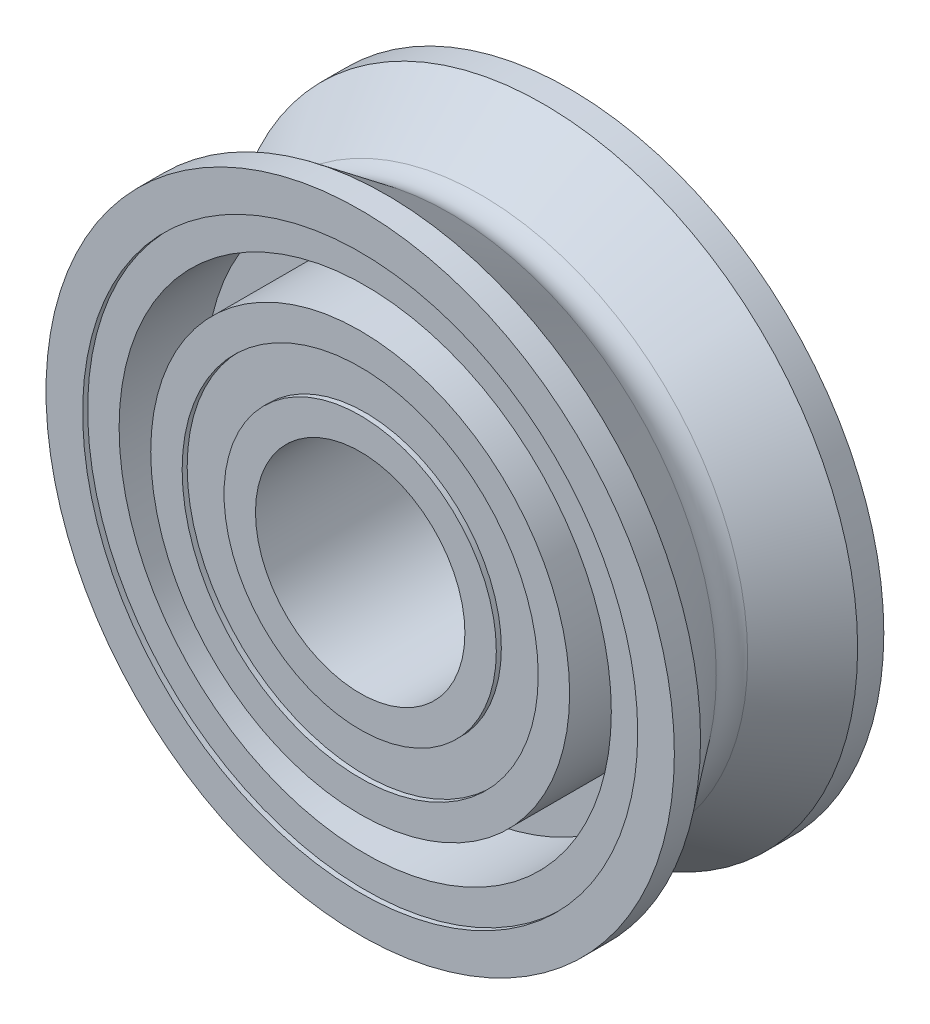
ISO-10303-21;
HEADER;
FILE_DESCRIPTION(('STEP AP214'),'2;1');
FILE_NAME('part.step','',(''),(''),'','','');
FILE_SCHEMA(('AUTOMOTIVE_DESIGN { 1 0 10303 214 1 1 1 1 }'));
ENDSEC;
DATA;
#1=APPLICATION_CONTEXT('core data for automotive mechanical design processes');
#2=APPLICATION_PROTOCOL_DEFINITION('international standard','automotive_design',2000,#1);
#3=PRODUCT_CONTEXT('',#1,'mechanical');
#4=PRODUCT('Part','Part','',(#3));
#5=PRODUCT_RELATED_PRODUCT_CATEGORY('part','',(#4));
#6=PRODUCT_DEFINITION_FORMATION('','',#4);
#7=PRODUCT_DEFINITION_CONTEXT('part definition',#1,'design');
#8=PRODUCT_DEFINITION('design','',#6,#7);
#9=PRODUCT_DEFINITION_SHAPE('','',#8);
#10=(LENGTH_UNIT() NAMED_UNIT(*) SI_UNIT(.MILLI.,.METRE.));
#11=(NAMED_UNIT(*) PLANE_ANGLE_UNIT() SI_UNIT($,.RADIAN.));
#12=(NAMED_UNIT(*) SI_UNIT($,.STERADIAN.) SOLID_ANGLE_UNIT());
#13=UNCERTAINTY_MEASURE_WITH_UNIT(LENGTH_MEASURE(1.E-05),#10,'distance_accuracy_value','');
#14=(GEOMETRIC_REPRESENTATION_CONTEXT(3) GLOBAL_UNCERTAINTY_ASSIGNED_CONTEXT((#13)) GLOBAL_UNIT_ASSIGNED_CONTEXT((#10,
#11,#12)) REPRESENTATION_CONTEXT('',''));
#15=CARTESIAN_POINT('',(0.,0.,0.));
#16=DIRECTION('',(0.,0.,1.));
#17=DIRECTION('',(1.,0.,0.));
#18=AXIS2_PLACEMENT_3D('',#15,#16,#17);
#19=CARTESIAN_POINT('',(0.,0.,0.));
#20=DIRECTION('',(0.,0.,1.));
#21=DIRECTION('',(1.,0.,0.));
#22=AXIS2_PLACEMENT_3D('',#19,#20,#21);
#23=TOROIDAL_SURFACE('',#22,4.365625,0.396874999999999);
#24=CARTESIAN_POINT('',(0.,0.,0.238125));
#25=DIRECTION('',(0.,0.,1.));
#26=DIRECTION('',(1.,0.,0.));
#27=AXIS2_PLACEMENT_3D('',#24,#25,#26);
#28=CIRCLE('',#27,4.048125);
#29=CARTESIAN_POINT('',(4.048125,0.,0.238125));
#30=VERTEX_POINT('',#29);
#31=EDGE_CURVE('E10',#30,#30,#28,.T.);
#32=ORIENTED_EDGE('',*,*,#31,.F.);
#33=EDGE_LOOP('',(#32));
#34=FACE_BOUND('',#33,.T.);
#35=CARTESIAN_POINT('',(0.,0.,-0.238125));
#36=DIRECTION('',(0.,0.,1.));
#37=DIRECTION('',(1.,0.,0.));
#38=AXIS2_PLACEMENT_3D('',#35,#36,#37);
#39=CIRCLE('',#38,4.048125);
#40=CARTESIAN_POINT('',(4.048125,0.,-0.238125));
#41=VERTEX_POINT('',#40);
#42=EDGE_CURVE('E117',#41,#41,#39,.T.);
#43=ORIENTED_EDGE('',*,*,#42,.T.);
#44=EDGE_LOOP('',(#43));
#45=FACE_BOUND('',#44,.T.);
#46=ADVANCED_FACE('F29',(#34,#45),#23,.F.);
#47=CARTESIAN_POINT('',(0.,0.,0.238125));
#48=DIRECTION('',(0.,0.,1.));
#49=DIRECTION('',(1.,0.,0.));
#50=AXIS2_PLACEMENT_3D('',#47,#48,#49);
#51=CONICAL_SURFACE('',#50,4.048125,0.643501108793284);
#52=CARTESIAN_POINT('',(0.,0.,1.190625));
#53=DIRECTION('',(0.,0.,1.));
#54=DIRECTION('',(1.,0.,0.));
#55=AXIS2_PLACEMENT_3D('',#52,#53,#54);
#56=CIRCLE('',#55,4.7625);
#57=CARTESIAN_POINT('',(4.7625,0.,1.190625));
#58=VERTEX_POINT('',#57);
#59=EDGE_CURVE('E35',#58,#58,#56,.T.);
#60=ORIENTED_EDGE('',*,*,#59,.F.);
#61=EDGE_LOOP('',(#60));
#62=FACE_BOUND('',#61,.T.);
#63=ORIENTED_EDGE('',*,*,#31,.T.);
#64=EDGE_LOOP('',(#63));
#65=FACE_BOUND('',#64,.T.);
#66=ADVANCED_FACE('F274',(#62,#65),#51,.T.);
#67=CARTESIAN_POINT('',(0.,0.,1.5875));
#68=DIRECTION('',(0.,0.,1.));
#69=DIRECTION('',(1.,0.,0.));
#70=AXIS2_PLACEMENT_3D('',#67,#68,#69);
#71=CYLINDRICAL_SURFACE('',#70,4.7625);
#72=CARTESIAN_POINT('',(0.,0.,1.5875));
#73=DIRECTION('',(0.,0.,1.));
#74=DIRECTION('',(1.,0.,0.));
#75=AXIS2_PLACEMENT_3D('',#72,#73,#74);
#76=CIRCLE('',#75,4.7625);
#77=CARTESIAN_POINT('',(4.7625,0.,1.5875));
#78=VERTEX_POINT('',#77);
#79=EDGE_CURVE('E39',#78,#78,#76,.T.);
#80=ORIENTED_EDGE('',*,*,#79,.F.);
#81=EDGE_LOOP('',(#80));
#82=FACE_BOUND('',#81,.T.);
#83=ORIENTED_EDGE('',*,*,#59,.T.);
#84=EDGE_LOOP('',(#83));
#85=FACE_BOUND('',#84,.T.);
#86=ADVANCED_FACE('F269',(#82,#85),#71,.T.);
#87=CARTESIAN_POINT('',(0.,4.206875,1.5875));
#88=DIRECTION('',(0.,0.,-1.));
#89=DIRECTION('',(-1.,0.,0.));
#90=AXIS2_PLACEMENT_3D('',#87,#88,#89);
#91=PLANE('',#90);
#92=CARTESIAN_POINT('',(0.,0.,1.5875));
#93=DIRECTION('',(0.,0.,1.));
#94=DIRECTION('',(1.,0.,0.));
#95=AXIS2_PLACEMENT_3D('',#92,#93,#94);
#96=CIRCLE('',#95,4.206875);
#97=CARTESIAN_POINT('',(4.206875,0.,1.5875));
#98=VERTEX_POINT('',#97);
#99=EDGE_CURVE('E43',#98,#98,#96,.T.);
#100=ORIENTED_EDGE('',*,*,#99,.F.);
#101=EDGE_LOOP('',(#100));
#102=FACE_BOUND('',#101,.T.);
#103=ORIENTED_EDGE('',*,*,#79,.T.);
#104=EDGE_LOOP('',(#103));
#105=FACE_BOUND('',#104,.T.);
#106=ADVANCED_FACE('F263',(#102,#105),#91,.F.);
#107=CARTESIAN_POINT('',(0.,0.,1.5875));
#108=DIRECTION('',(0.,0.,1.));
#109=DIRECTION('',(1.,0.,0.));
#110=AXIS2_PLACEMENT_3D('',#107,#108,#109);
#111=CYLINDRICAL_SURFACE('',#110,4.206875);
#112=CARTESIAN_POINT('',(0.,0.,1.5113));
#113=DIRECTION('',(0.,0.,1.));
#114=DIRECTION('',(1.,0.,0.));
#115=AXIS2_PLACEMENT_3D('',#112,#113,#114);
#116=CIRCLE('',#115,4.206875);
#117=CARTESIAN_POINT('',(4.206875,0.,1.5113));
#118=VERTEX_POINT('',#117);
#119=EDGE_CURVE('E48',#118,#118,#116,.T.);
#120=ORIENTED_EDGE('',*,*,#119,.F.);
#121=EDGE_LOOP('',(#120));
#122=FACE_BOUND('',#121,.T.);
#123=ORIENTED_EDGE('',*,*,#99,.T.);
#124=EDGE_LOOP('',(#123));
#125=FACE_BOUND('',#124,.T.);
#126=ADVANCED_FACE('F257',(#122,#125),#111,.F.);
#127=CARTESIAN_POINT('',(0.,4.206875,1.5113));
#128=DIRECTION('',(0.,0.,-1.));
#129=DIRECTION('',(-1.,0.,0.));
#130=AXIS2_PLACEMENT_3D('',#127,#128,#129);
#131=PLANE('',#130);
#132=CARTESIAN_POINT('',(0.,0.,1.5113));
#133=DIRECTION('',(0.,0.,1.));
#134=DIRECTION('',(1.,0.,0.));
#135=AXIS2_PLACEMENT_3D('',#132,#133,#134);
#136=CIRCLE('',#135,3.730625);
#137=CARTESIAN_POINT('',(3.730625,0.,1.5113));
#138=VERTEX_POINT('',#137);
#139=EDGE_CURVE('E51',#138,#138,#136,.T.);
#140=ORIENTED_EDGE('',*,*,#139,.F.);
#141=EDGE_LOOP('',(#140));
#142=FACE_BOUND('',#141,.T.);
#143=ORIENTED_EDGE('',*,*,#119,.T.);
#144=EDGE_LOOP('',(#143));
#145=FACE_BOUND('',#144,.T.);
#146=ADVANCED_FACE('F251',(#142,#145),#131,.F.);
#147=CARTESIAN_POINT('',(0.,0.,1.5875));
#148=DIRECTION('',(0.,0.,1.));
#149=DIRECTION('',(1.,0.,0.));
#150=AXIS2_PLACEMENT_3D('',#147,#148,#149);
#151=CYLINDRICAL_SURFACE('',#150,3.730625);
#152=CARTESIAN_POINT('',(0.,0.,0.1984375));
#153=DIRECTION('',(0.,0.,1.));
#154=DIRECTION('',(1.,0.,0.));
#155=AXIS2_PLACEMENT_3D('',#152,#153,#154);
#156=CIRCLE('',#155,3.730625);
#157=CARTESIAN_POINT('',(3.730625,0.,0.1984375));
#158=VERTEX_POINT('',#157);
#159=EDGE_CURVE('E54',#158,#158,#156,.T.);
#160=ORIENTED_EDGE('',*,*,#159,.F.);
#161=EDGE_LOOP('',(#160));
#162=FACE_BOUND('',#161,.T.);
#163=ORIENTED_EDGE('',*,*,#139,.T.);
#164=EDGE_LOOP('',(#163));
#165=FACE_BOUND('',#164,.T.);
#166=ADVANCED_FACE('F245',(#162,#165),#151,.F.);
#167=CARTESIAN_POINT('',(0.,3.730625,0.1984375));
#168=DIRECTION('',(0.,0.,-1.));
#169=DIRECTION('',(-1.,0.,0.));
#170=AXIS2_PLACEMENT_3D('',#167,#168,#169);
#171=PLANE('',#170);
#172=CARTESIAN_POINT('',(0.,0.,0.1984375));
#173=DIRECTION('',(0.,0.,1.));
#174=DIRECTION('',(1.,0.,0.));
#175=AXIS2_PLACEMENT_3D('',#172,#173,#174);
#176=CIRCLE('',#175,3.175);
#177=CARTESIAN_POINT('',(3.175,0.,0.1984375));
#178=VERTEX_POINT('',#177);
#179=EDGE_CURVE('E57',#178,#178,#176,.T.);
#180=ORIENTED_EDGE('',*,*,#179,.F.);
#181=EDGE_LOOP('',(#180));
#182=FACE_BOUND('',#181,.T.);
#183=ORIENTED_EDGE('',*,*,#159,.T.);
#184=EDGE_LOOP('',(#183));
#185=FACE_BOUND('',#184,.T.);
#186=ADVANCED_FACE('F239',(#182,#185),#171,.F.);
#187=CARTESIAN_POINT('',(0.,0.,1.5875));
#188=DIRECTION('',(0.,0.,1.));
#189=DIRECTION('',(1.,0.,0.));
#190=AXIS2_PLACEMENT_3D('',#187,#188,#189);
#191=CYLINDRICAL_SURFACE('',#190,3.175);
#192=CARTESIAN_POINT('',(0.,0.,1.5875));
#193=DIRECTION('',(0.,0.,1.));
#194=DIRECTION('',(1.,0.,0.));
#195=AXIS2_PLACEMENT_3D('',#192,#193,#194);
#196=CIRCLE('',#195,3.175);
#197=CARTESIAN_POINT('',(3.175,0.,1.5875));
#198=VERTEX_POINT('',#197);
#199=EDGE_CURVE('E60',#198,#198,#196,.T.);
#200=ORIENTED_EDGE('',*,*,#199,.F.);
#201=EDGE_LOOP('',(#200));
#202=FACE_BOUND('',#201,.T.);
#203=ORIENTED_EDGE('',*,*,#179,.T.);
#204=EDGE_LOOP('',(#203));
#205=FACE_BOUND('',#204,.T.);
#206=ADVANCED_FACE('F233',(#202,#205),#191,.T.);
#207=CARTESIAN_POINT('',(0.,2.69875,1.5875));
#208=DIRECTION('',(0.,0.,-1.));
#209=DIRECTION('',(-1.,0.,0.));
#210=AXIS2_PLACEMENT_3D('',#207,#208,#209);
#211=PLANE('',#210);
#212=CARTESIAN_POINT('',(0.,0.,1.5875));
#213=DIRECTION('',(0.,0.,1.));
#214=DIRECTION('',(1.,0.,0.));
#215=AXIS2_PLACEMENT_3D('',#212,#213,#214);
#216=CIRCLE('',#215,2.69875);
#217=CARTESIAN_POINT('',(2.69875,0.,1.5875));
#218=VERTEX_POINT('',#217);
#219=EDGE_CURVE('E63',#218,#218,#216,.T.);
#220=ORIENTED_EDGE('',*,*,#219,.F.);
#221=EDGE_LOOP('',(#220));
#222=FACE_BOUND('',#221,.T.);
#223=ORIENTED_EDGE('',*,*,#199,.T.);
#224=EDGE_LOOP('',(#223));
#225=FACE_BOUND('',#224,.T.);
#226=ADVANCED_FACE('F227',(#222,#225),#211,.F.);
#227=CARTESIAN_POINT('',(0.,0.,1.5875));
#228=DIRECTION('',(0.,0.,1.));
#229=DIRECTION('',(1.,0.,0.));
#230=AXIS2_PLACEMENT_3D('',#227,#228,#229);
#231=CYLINDRICAL_SURFACE('',#230,2.69875);
#232=CARTESIAN_POINT('',(0.,0.,1.5113));
#233=DIRECTION('',(0.,0.,1.));
#234=DIRECTION('',(1.,0.,0.));
#235=AXIS2_PLACEMENT_3D('',#232,#233,#234);
#236=CIRCLE('',#235,2.69875);
#237=CARTESIAN_POINT('',(2.69875,0.,1.5113));
#238=VERTEX_POINT('',#237);
#239=EDGE_CURVE('E66',#238,#238,#236,.T.);
#240=ORIENTED_EDGE('',*,*,#239,.F.);
#241=EDGE_LOOP('',(#240));
#242=FACE_BOUND('',#241,.T.);
#243=ORIENTED_EDGE('',*,*,#219,.T.);
#244=EDGE_LOOP('',(#243));
#245=FACE_BOUND('',#244,.T.);
#246=ADVANCED_FACE('F221',(#242,#245),#231,.F.);
#247=CARTESIAN_POINT('',(0.,2.06375,1.5113));
#248=DIRECTION('',(0.,0.,-1.));
#249=DIRECTION('',(-1.,0.,0.));
#250=AXIS2_PLACEMENT_3D('',#247,#248,#249);
#251=PLANE('',#250);
#252=CARTESIAN_POINT('',(0.,0.,1.5113));
#253=DIRECTION('',(0.,0.,1.));
#254=DIRECTION('',(1.,0.,0.));
#255=AXIS2_PLACEMENT_3D('',#252,#253,#254);
#256=CIRCLE('',#255,2.06375);
#257=CARTESIAN_POINT('',(2.06375,0.,1.5113));
#258=VERTEX_POINT('',#257);
#259=EDGE_CURVE('E69',#258,#258,#256,.T.);
#260=ORIENTED_EDGE('',*,*,#259,.F.);
#261=EDGE_LOOP('',(#260));
#262=FACE_BOUND('',#261,.T.);
#263=ORIENTED_EDGE('',*,*,#239,.T.);
#264=EDGE_LOOP('',(#263));
#265=FACE_BOUND('',#264,.T.);
#266=ADVANCED_FACE('F215',(#262,#265),#251,.F.);
#267=CARTESIAN_POINT('',(0.,0.,1.5875));
#268=DIRECTION('',(0.,0.,1.));
#269=DIRECTION('',(1.,0.,0.));
#270=AXIS2_PLACEMENT_3D('',#267,#268,#269);
#271=CYLINDRICAL_SURFACE('',#270,2.06375);
#272=CARTESIAN_POINT('',(0.,0.,1.5875));
#273=DIRECTION('',(0.,0.,1.));
#274=DIRECTION('',(1.,0.,0.));
#275=AXIS2_PLACEMENT_3D('',#272,#273,#274);
#276=CIRCLE('',#275,2.06375);
#277=CARTESIAN_POINT('',(2.06375,0.,1.5875));
#278=VERTEX_POINT('',#277);
#279=EDGE_CURVE('E72',#278,#278,#276,.T.);
#280=ORIENTED_EDGE('',*,*,#279,.F.);
#281=EDGE_LOOP('',(#280));
#282=FACE_BOUND('',#281,.T.);
#283=ORIENTED_EDGE('',*,*,#259,.T.);
#284=EDGE_LOOP('',(#283));
#285=FACE_BOUND('',#284,.T.);
#286=ADVANCED_FACE('F209',(#282,#285),#271,.T.);
#287=CARTESIAN_POINT('',(0.,2.06375,1.5875));
#288=DIRECTION('',(0.,0.,-1.));
#289=DIRECTION('',(-1.,0.,0.));
#290=AXIS2_PLACEMENT_3D('',#287,#288,#289);
#291=PLANE('',#290);
#292=CARTESIAN_POINT('',(0.,0.,1.5875));
#293=DIRECTION('',(0.,0.,1.));
#294=DIRECTION('',(1.,0.,0.));
#295=AXIS2_PLACEMENT_3D('',#292,#293,#294);
#296=CIRCLE('',#295,1.5875);
#297=CARTESIAN_POINT('',(1.5875,0.,1.5875));
#298=VERTEX_POINT('',#297);
#299=EDGE_CURVE('E75',#298,#298,#296,.T.);
#300=ORIENTED_EDGE('',*,*,#299,.F.);
#301=EDGE_LOOP('',(#300));
#302=FACE_BOUND('',#301,.T.);
#303=ORIENTED_EDGE('',*,*,#279,.T.);
#304=EDGE_LOOP('',(#303));
#305=FACE_BOUND('',#304,.T.);
#306=ADVANCED_FACE('F203',(#302,#305),#291,.F.);
#307=CARTESIAN_POINT('',(0.,0.,1.5875));
#308=DIRECTION('',(0.,0.,1.));
#309=DIRECTION('',(1.,0.,0.));
#310=AXIS2_PLACEMENT_3D('',#307,#308,#309);
#311=CYLINDRICAL_SURFACE('',#310,1.5875);
#312=CARTESIAN_POINT('',(0.,0.,-1.5875));
#313=DIRECTION('',(0.,0.,1.));
#314=DIRECTION('',(1.,0.,0.));
#315=AXIS2_PLACEMENT_3D('',#312,#313,#314);
#316=CIRCLE('',#315,1.5875);
#317=CARTESIAN_POINT('',(1.5875,0.,-1.5875));
#318=VERTEX_POINT('',#317);
#319=EDGE_CURVE('E78',#318,#318,#316,.T.);
#320=ORIENTED_EDGE('',*,*,#319,.F.);
#321=EDGE_LOOP('',(#320));
#322=FACE_BOUND('',#321,.T.);
#323=ORIENTED_EDGE('',*,*,#299,.T.);
#324=EDGE_LOOP('',(#323));
#325=FACE_BOUND('',#324,.T.);
#326=ADVANCED_FACE('F197',(#322,#325),#311,.F.);
#327=CARTESIAN_POINT('',(0.,2.06375,-1.5875));
#328=DIRECTION('',(0.,0.,1.));
#329=DIRECTION('',(1.,0.,0.));
#330=AXIS2_PLACEMENT_3D('',#327,#328,#329);
#331=PLANE('',#330);
#332=CARTESIAN_POINT('',(0.,0.,-1.5875));
#333=DIRECTION('',(0.,0.,1.));
#334=DIRECTION('',(1.,0.,0.));
#335=AXIS2_PLACEMENT_3D('',#332,#333,#334);
#336=CIRCLE('',#335,2.06375);
#337=CARTESIAN_POINT('',(2.06375,0.,-1.5875));
#338=VERTEX_POINT('',#337);
#339=EDGE_CURVE('E81',#338,#338,#336,.T.);
#340=ORIENTED_EDGE('',*,*,#339,.F.);
#341=EDGE_LOOP('',(#340));
#342=FACE_BOUND('',#341,.T.);
#343=ORIENTED_EDGE('',*,*,#319,.T.);
#344=EDGE_LOOP('',(#343));
#345=FACE_BOUND('',#344,.T.);
#346=ADVANCED_FACE('F191',(#342,#345),#331,.F.);
#347=CARTESIAN_POINT('',(0.,0.,1.5875));
#348=DIRECTION('',(0.,0.,1.));
#349=DIRECTION('',(1.,0.,0.));
#350=AXIS2_PLACEMENT_3D('',#347,#348,#349);
#351=CYLINDRICAL_SURFACE('',#350,2.06375);
#352=CARTESIAN_POINT('',(0.,0.,-1.5113));
#353=DIRECTION('',(0.,0.,1.));
#354=DIRECTION('',(1.,0.,0.));
#355=AXIS2_PLACEMENT_3D('',#352,#353,#354);
#356=CIRCLE('',#355,2.06375);
#357=CARTESIAN_POINT('',(2.06375,0.,-1.5113));
#358=VERTEX_POINT('',#357);
#359=EDGE_CURVE('E84',#358,#358,#356,.T.);
#360=ORIENTED_EDGE('',*,*,#359,.F.);
#361=EDGE_LOOP('',(#360));
#362=FACE_BOUND('',#361,.T.);
#363=ORIENTED_EDGE('',*,*,#339,.T.);
#364=EDGE_LOOP('',(#363));
#365=FACE_BOUND('',#364,.T.);
#366=ADVANCED_FACE('F185',(#362,#365),#351,.T.);
#367=CARTESIAN_POINT('',(0.,2.69875,-1.5113));
#368=DIRECTION('',(0.,0.,1.));
#369=DIRECTION('',(1.,0.,0.));
#370=AXIS2_PLACEMENT_3D('',#367,#368,#369);
#371=PLANE('',#370);
#372=CARTESIAN_POINT('',(0.,0.,-1.5113));
#373=DIRECTION('',(0.,0.,1.));
#374=DIRECTION('',(1.,0.,0.));
#375=AXIS2_PLACEMENT_3D('',#372,#373,#374);
#376=CIRCLE('',#375,2.69875);
#377=CARTESIAN_POINT('',(2.69875,0.,-1.5113));
#378=VERTEX_POINT('',#377);
#379=EDGE_CURVE('E87',#378,#378,#376,.T.);
#380=ORIENTED_EDGE('',*,*,#379,.F.);
#381=EDGE_LOOP('',(#380));
#382=FACE_BOUND('',#381,.T.);
#383=ORIENTED_EDGE('',*,*,#359,.T.);
#384=EDGE_LOOP('',(#383));
#385=FACE_BOUND('',#384,.T.);
#386=ADVANCED_FACE('F179',(#382,#385),#371,.F.);
#387=CARTESIAN_POINT('',(0.,0.,1.5875));
#388=DIRECTION('',(0.,0.,1.));
#389=DIRECTION('',(1.,0.,0.));
#390=AXIS2_PLACEMENT_3D('',#387,#388,#389);
#391=CYLINDRICAL_SURFACE('',#390,2.69875);
#392=CARTESIAN_POINT('',(0.,0.,-1.5875));
#393=DIRECTION('',(0.,0.,1.));
#394=DIRECTION('',(1.,0.,0.));
#395=AXIS2_PLACEMENT_3D('',#392,#393,#394);
#396=CIRCLE('',#395,2.69875);
#397=CARTESIAN_POINT('',(2.69875,0.,-1.5875));
#398=VERTEX_POINT('',#397);
#399=EDGE_CURVE('E90',#398,#398,#396,.T.);
#400=ORIENTED_EDGE('',*,*,#399,.F.);
#401=EDGE_LOOP('',(#400));
#402=FACE_BOUND('',#401,.T.);
#403=ORIENTED_EDGE('',*,*,#379,.T.);
#404=EDGE_LOOP('',(#403));
#405=FACE_BOUND('',#404,.T.);
#406=ADVANCED_FACE('F173',(#402,#405),#391,.F.);
#407=CARTESIAN_POINT('',(0.,3.175,-1.5875));
#408=DIRECTION('',(0.,0.,1.));
#409=DIRECTION('',(1.,0.,0.));
#410=AXIS2_PLACEMENT_3D('',#407,#408,#409);
#411=PLANE('',#410);
#412=CARTESIAN_POINT('',(0.,0.,-1.5875));
#413=DIRECTION('',(0.,0.,1.));
#414=DIRECTION('',(1.,0.,0.));
#415=AXIS2_PLACEMENT_3D('',#412,#413,#414);
#416=CIRCLE('',#415,3.175);
#417=CARTESIAN_POINT('',(3.175,0.,-1.5875));
#418=VERTEX_POINT('',#417);
#419=EDGE_CURVE('E93',#418,#418,#416,.T.);
#420=ORIENTED_EDGE('',*,*,#419,.F.);
#421=EDGE_LOOP('',(#420));
#422=FACE_BOUND('',#421,.T.);
#423=ORIENTED_EDGE('',*,*,#399,.T.);
#424=EDGE_LOOP('',(#423));
#425=FACE_BOUND('',#424,.T.);
#426=ADVANCED_FACE('F167',(#422,#425),#411,.F.);
#427=CARTESIAN_POINT('',(0.,0.,1.5875));
#428=DIRECTION('',(0.,0.,1.));
#429=DIRECTION('',(1.,0.,0.));
#430=AXIS2_PLACEMENT_3D('',#427,#428,#429);
#431=CYLINDRICAL_SURFACE('',#430,3.175);
#432=CARTESIAN_POINT('',(0.,0.,-0.1984375));
#433=DIRECTION('',(0.,0.,1.));
#434=DIRECTION('',(1.,0.,0.));
#435=AXIS2_PLACEMENT_3D('',#432,#433,#434);
#436=CIRCLE('',#435,3.175);
#437=CARTESIAN_POINT('',(3.175,0.,-0.1984375));
#438=VERTEX_POINT('',#437);
#439=EDGE_CURVE('E96',#438,#438,#436,.T.);
#440=ORIENTED_EDGE('',*,*,#439,.F.);
#441=EDGE_LOOP('',(#440));
#442=FACE_BOUND('',#441,.T.);
#443=ORIENTED_EDGE('',*,*,#419,.T.);
#444=EDGE_LOOP('',(#443));
#445=FACE_BOUND('',#444,.T.);
#446=ADVANCED_FACE('F161',(#442,#445),#431,.T.);
#447=CARTESIAN_POINT('',(0.,3.730625,-0.1984375));
#448=DIRECTION('',(0.,0.,1.));
#449=DIRECTION('',(1.,0.,0.));
#450=AXIS2_PLACEMENT_3D('',#447,#448,#449);
#451=PLANE('',#450);
#452=CARTESIAN_POINT('',(0.,0.,-0.1984375));
#453=DIRECTION('',(0.,0.,1.));
#454=DIRECTION('',(1.,0.,0.));
#455=AXIS2_PLACEMENT_3D('',#452,#453,#454);
#456=CIRCLE('',#455,3.730625);
#457=CARTESIAN_POINT('',(3.730625,0.,-0.1984375));
#458=VERTEX_POINT('',#457);
#459=EDGE_CURVE('E99',#458,#458,#456,.T.);
#460=ORIENTED_EDGE('',*,*,#459,.F.);
#461=EDGE_LOOP('',(#460));
#462=FACE_BOUND('',#461,.T.);
#463=ORIENTED_EDGE('',*,*,#439,.T.);
#464=EDGE_LOOP('',(#463));
#465=FACE_BOUND('',#464,.T.);
#466=ADVANCED_FACE('F155',(#462,#465),#451,.F.);
#467=CARTESIAN_POINT('',(0.,0.,1.5875));
#468=DIRECTION('',(0.,0.,1.));
#469=DIRECTION('',(1.,0.,0.));
#470=AXIS2_PLACEMENT_3D('',#467,#468,#469);
#471=CYLINDRICAL_SURFACE('',#470,3.730625);
#472=CARTESIAN_POINT('',(0.,0.,-1.5113));
#473=DIRECTION('',(0.,0.,1.));
#474=DIRECTION('',(1.,0.,0.));
#475=AXIS2_PLACEMENT_3D('',#472,#473,#474);
#476=CIRCLE('',#475,3.730625);
#477=CARTESIAN_POINT('',(3.730625,0.,-1.5113));
#478=VERTEX_POINT('',#477);
#479=EDGE_CURVE('E102',#478,#478,#476,.T.);
#480=ORIENTED_EDGE('',*,*,#479,.F.);
#481=EDGE_LOOP('',(#480));
#482=FACE_BOUND('',#481,.T.);
#483=ORIENTED_EDGE('',*,*,#459,.T.);
#484=EDGE_LOOP('',(#483));
#485=FACE_BOUND('',#484,.T.);
#486=ADVANCED_FACE('F149',(#482,#485),#471,.F.);
#487=CARTESIAN_POINT('',(0.,4.206875,-1.5113));
#488=DIRECTION('',(0.,0.,1.));
#489=DIRECTION('',(1.,0.,0.));
#490=AXIS2_PLACEMENT_3D('',#487,#488,#489);
#491=PLANE('',#490);
#492=CARTESIAN_POINT('',(0.,0.,-1.5113));
#493=DIRECTION('',(0.,0.,1.));
#494=DIRECTION('',(1.,0.,0.));
#495=AXIS2_PLACEMENT_3D('',#492,#493,#494);
#496=CIRCLE('',#495,4.206875);
#497=CARTESIAN_POINT('',(4.206875,0.,-1.5113));
#498=VERTEX_POINT('',#497);
#499=EDGE_CURVE('E105',#498,#498,#496,.T.);
#500=ORIENTED_EDGE('',*,*,#499,.F.);
#501=EDGE_LOOP('',(#500));
#502=FACE_BOUND('',#501,.T.);
#503=ORIENTED_EDGE('',*,*,#479,.T.);
#504=EDGE_LOOP('',(#503));
#505=FACE_BOUND('',#504,.T.);
#506=ADVANCED_FACE('F143',(#502,#505),#491,.F.);
#507=CARTESIAN_POINT('',(0.,0.,1.5875));
#508=DIRECTION('',(0.,0.,1.));
#509=DIRECTION('',(1.,0.,0.));
#510=AXIS2_PLACEMENT_3D('',#507,#508,#509);
#511=CYLINDRICAL_SURFACE('',#510,4.206875);
#512=CARTESIAN_POINT('',(0.,0.,-1.5875));
#513=DIRECTION('',(0.,0.,1.));
#514=DIRECTION('',(1.,0.,0.));
#515=AXIS2_PLACEMENT_3D('',#512,#513,#514);
#516=CIRCLE('',#515,4.206875);
#517=CARTESIAN_POINT('',(4.206875,0.,-1.5875));
#518=VERTEX_POINT('',#517);
#519=EDGE_CURVE('E108',#518,#518,#516,.T.);
#520=ORIENTED_EDGE('',*,*,#519,.F.);
#521=EDGE_LOOP('',(#520));
#522=FACE_BOUND('',#521,.T.);
#523=ORIENTED_EDGE('',*,*,#499,.T.);
#524=EDGE_LOOP('',(#523));
#525=FACE_BOUND('',#524,.T.);
#526=ADVANCED_FACE('F137',(#522,#525),#511,.F.);
#527=CARTESIAN_POINT('',(0.,4.7625,-1.5875));
#528=DIRECTION('',(0.,0.,1.));
#529=DIRECTION('',(1.,0.,0.));
#530=AXIS2_PLACEMENT_3D('',#527,#528,#529);
#531=PLANE('',#530);
#532=CARTESIAN_POINT('',(0.,0.,-1.5875));
#533=DIRECTION('',(0.,0.,1.));
#534=DIRECTION('',(1.,0.,0.));
#535=AXIS2_PLACEMENT_3D('',#532,#533,#534);
#536=CIRCLE('',#535,4.7625);
#537=CARTESIAN_POINT('',(4.7625,0.,-1.5875));
#538=VERTEX_POINT('',#537);
#539=EDGE_CURVE('E111',#538,#538,#536,.T.);
#540=ORIENTED_EDGE('',*,*,#539,.F.);
#541=EDGE_LOOP('',(#540));
#542=FACE_BOUND('',#541,.T.);
#543=ORIENTED_EDGE('',*,*,#519,.T.);
#544=EDGE_LOOP('',(#543));
#545=FACE_BOUND('',#544,.T.);
#546=ADVANCED_FACE('F131',(#542,#545),#531,.F.);
#547=CARTESIAN_POINT('',(0.,0.,1.5875));
#548=DIRECTION('',(0.,0.,1.));
#549=DIRECTION('',(1.,0.,0.));
#550=AXIS2_PLACEMENT_3D('',#547,#548,#549);
#551=CYLINDRICAL_SURFACE('',#550,4.7625);
#552=CARTESIAN_POINT('',(0.,0.,-1.190625));
#553=DIRECTION('',(0.,0.,1.));
#554=DIRECTION('',(1.,0.,0.));
#555=AXIS2_PLACEMENT_3D('',#552,#553,#554);
#556=CIRCLE('',#555,4.7625);
#557=CARTESIAN_POINT('',(4.7625,0.,-1.190625));
#558=VERTEX_POINT('',#557);
#559=EDGE_CURVE('E114',#558,#558,#556,.T.);
#560=ORIENTED_EDGE('',*,*,#559,.F.);
#561=EDGE_LOOP('',(#560));
#562=FACE_BOUND('',#561,.T.);
#563=ORIENTED_EDGE('',*,*,#539,.T.);
#564=EDGE_LOOP('',(#563));
#565=FACE_BOUND('',#564,.T.);
#566=ADVANCED_FACE('F125',(#562,#565),#551,.T.);
#567=CARTESIAN_POINT('',(0.,0.,-1.190625));
#568=DIRECTION('',(0.,0.,-1.));
#569=DIRECTION('',(-1.,0.,0.));
#570=AXIS2_PLACEMENT_3D('',#567,#568,#569);
#571=CONICAL_SURFACE('',#570,4.7625,0.643501108793284);
#572=ORIENTED_EDGE('',*,*,#42,.F.);
#573=EDGE_LOOP('',(#572));
#574=FACE_BOUND('',#573,.T.);
#575=ORIENTED_EDGE('',*,*,#559,.T.);
#576=EDGE_LOOP('',(#575));
#577=FACE_BOUND('',#576,.T.);
#578=ADVANCED_FACE('F122',(#574,#577),#571,.T.);
#579=CLOSED_SHELL('',(#46,#66,#86,#106,#126,#146,#166,#186,#206,#226,#246,#266,#286,#306,#326,
#346,#366,#386,#406,#426,#446,#466,#486,#506,#526,#546,#566,#578));
#580=MANIFOLD_SOLID_BREP('B2',#579);
#581=ADVANCED_BREP_SHAPE_REPRESENTATION('',(#18,#580),#14);
#582=SHAPE_DEFINITION_REPRESENTATION(#9,#581);
ENDSEC;
END-ISO-10303-21;
